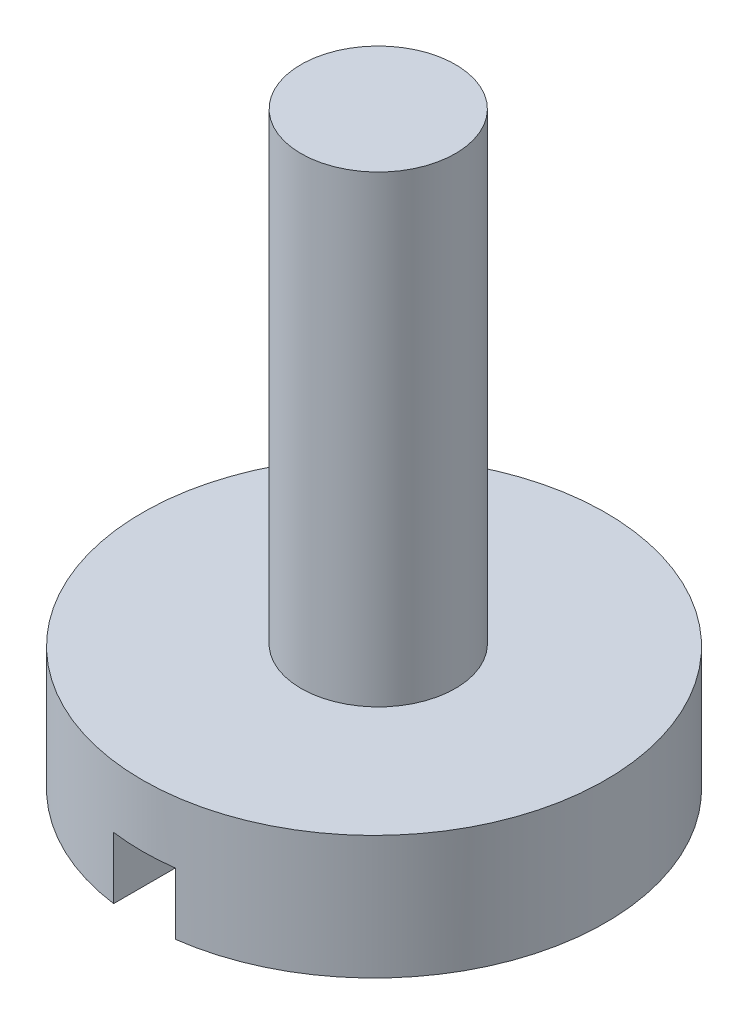
ISO-10303-21;
HEADER;
FILE_DESCRIPTION(('STEP AP214'),'2;1');
FILE_NAME('part.step','',(''),(''),'','','');
FILE_SCHEMA(('AUTOMOTIVE_DESIGN { 1 0 10303 214 1 1 1 1 }'));
ENDSEC;
DATA;
#1=APPLICATION_CONTEXT('core data for automotive mechanical design processes');
#2=APPLICATION_PROTOCOL_DEFINITION('international standard','automotive_design',2000,#1);
#3=PRODUCT_CONTEXT('',#1,'mechanical');
#4=PRODUCT('Part','Part','',(#3));
#5=PRODUCT_RELATED_PRODUCT_CATEGORY('part','',(#4));
#6=PRODUCT_DEFINITION_FORMATION('','',#4);
#7=PRODUCT_DEFINITION_CONTEXT('part definition',#1,'design');
#8=PRODUCT_DEFINITION('design','',#6,#7);
#9=PRODUCT_DEFINITION_SHAPE('','',#8);
#10=(LENGTH_UNIT() NAMED_UNIT(*) SI_UNIT(.MILLI.,.METRE.));
#11=(NAMED_UNIT(*) PLANE_ANGLE_UNIT() SI_UNIT($,.RADIAN.));
#12=(NAMED_UNIT(*) SI_UNIT($,.STERADIAN.) SOLID_ANGLE_UNIT());
#13=UNCERTAINTY_MEASURE_WITH_UNIT(LENGTH_MEASURE(1.E-05),#10,'distance_accuracy_value','');
#14=(GEOMETRIC_REPRESENTATION_CONTEXT(3) GLOBAL_UNCERTAINTY_ASSIGNED_CONTEXT((#13)) GLOBAL_UNIT_ASSIGNED_CONTEXT((#10,
#11,#12)) REPRESENTATION_CONTEXT('',''));
#15=CARTESIAN_POINT('',(0.,0.,0.));
#16=DIRECTION('',(0.,0.,1.));
#17=DIRECTION('',(1.,0.,0.));
#18=AXIS2_PLACEMENT_3D('',#15,#16,#17);
#19=CARTESIAN_POINT('',(0.,0.,0.));
#20=DIRECTION('',(0.,1.,0.));
#21=DIRECTION('',(0.,0.,1.));
#22=AXIS2_PLACEMENT_3D('',#19,#20,#21);
#23=PLANE('',#22);
#24=CARTESIAN_POINT('',(0.,0.,0.));
#25=DIRECTION('',(0.,1.,0.));
#26=DIRECTION('',(0.,0.,1.));
#27=AXIS2_PLACEMENT_3D('',#24,#25,#26);
#28=CIRCLE('',#27,7.5);
#29=CARTESIAN_POINT('',(1.,0.,7.43303437365925));
#30=VERTEX_POINT('',#29);
#31=CARTESIAN_POINT('',(1.,0.,-7.43303437365925));
#32=VERTEX_POINT('',#31);
#33=EDGE_CURVE('E90',#30,#32,#28,.T.);
#34=ORIENTED_EDGE('',*,*,#33,.F.);
#35=DIRECTION('',(0.,0.,-1.));
#36=VECTOR('',#35,1.);
#37=CARTESIAN_POINT('',(1.,0.,0.));
#38=LINE('',#37,#36);
#39=EDGE_CURVE('E80',#30,#32,#38,.T.);
#40=ORIENTED_EDGE('',*,*,#39,.T.);
#41=EDGE_LOOP('',(#34,#40));
#42=FACE_BOUND('',#41,.T.);
#43=ADVANCED_FACE('F35',(#42),#23,.F.);
#44=CARTESIAN_POINT('',(0.,4.,0.));
#45=DIRECTION('',(0.,1.,0.));
#46=DIRECTION('',(0.,0.,1.));
#47=AXIS2_PLACEMENT_3D('',#44,#45,#46);
#48=PLANE('',#47);
#49=CARTESIAN_POINT('',(0.,4.,0.));
#50=DIRECTION('',(0.,1.,0.));
#51=DIRECTION('',(0.,0.,1.));
#52=AXIS2_PLACEMENT_3D('',#49,#50,#51);
#53=CIRCLE('',#52,7.5);
#54=CARTESIAN_POINT('',(0.,4.,7.5));
#55=VERTEX_POINT('',#54);
#56=EDGE_CURVE('E81',#55,#55,#53,.T.);
#57=ORIENTED_EDGE('',*,*,#56,.T.);
#58=EDGE_LOOP('',(#57));
#59=FACE_BOUND('',#58,.T.);
#60=CARTESIAN_POINT('',(0.,4.,-0.136309695628481));
#61=DIRECTION('',(0.,1.,0.));
#62=DIRECTION('',(0.,0.,1.));
#63=AXIS2_PLACEMENT_3D('',#60,#61,#62);
#64=CIRCLE('',#63,2.5);
#65=CARTESIAN_POINT('',(0.,4.,2.36369030437152));
#66=VERTEX_POINT('',#65);
#67=EDGE_CURVE('E95',#66,#66,#64,.T.);
#68=ORIENTED_EDGE('',*,*,#67,.F.);
#69=EDGE_LOOP('',(#68));
#70=FACE_BOUND('',#69,.T.);
#71=ADVANCED_FACE('F120',(#59,#70),#48,.T.);
#72=CARTESIAN_POINT('',(0.,4.,0.));
#73=DIRECTION('',(0.,-1.,0.));
#74=DIRECTION('',(0.,0.,-1.));
#75=AXIS2_PLACEMENT_3D('',#72,#73,#74);
#76=CYLINDRICAL_SURFACE('',#75,7.5);
#77=CARTESIAN_POINT('',(0.,2.,0.));
#78=DIRECTION('',(0.,-1.,0.));
#79=DIRECTION('',(0.,0.,-1.));
#80=AXIS2_PLACEMENT_3D('',#77,#78,#79);
#81=CIRCLE('',#80,7.5);
#82=CARTESIAN_POINT('',(1.,2.,7.43303437365925));
#83=VERTEX_POINT('',#82);
#84=CARTESIAN_POINT('',(-1.,2.,7.43303437365925));
#85=VERTEX_POINT('',#84);
#86=EDGE_CURVE('E11',#83,#85,#81,.T.);
#87=ORIENTED_EDGE('',*,*,#86,.F.);
#88=DIRECTION('',(0.,-1.,0.));
#89=VECTOR('',#88,1.);
#90=CARTESIAN_POINT('',(1.,4.,7.43303437365925));
#91=LINE('',#90,#89);
#92=EDGE_CURVE('E110',#83,#30,#91,.T.);
#93=ORIENTED_EDGE('',*,*,#92,.T.);
#94=ORIENTED_EDGE('',*,*,#33,.T.);
#95=DIRECTION('',(0.,-1.,0.));
#96=VECTOR('',#95,1.);
#97=CARTESIAN_POINT('',(1.,4.,-7.43303437365925));
#98=LINE('',#97,#96);
#99=CARTESIAN_POINT('',(1.,2.,-7.43303437365925));
#100=VERTEX_POINT('',#99);
#101=EDGE_CURVE('E87',#32,#100,#98,.F.);
#102=ORIENTED_EDGE('',*,*,#101,.T.);
#103=CARTESIAN_POINT('',(-1.,2.,-7.43303437365925));
#104=VERTEX_POINT('',#103);
#105=EDGE_CURVE('E39',#104,#100,#81,.T.);
#106=ORIENTED_EDGE('',*,*,#105,.F.);
#107=DIRECTION('',(0.,-1.,0.));
#108=VECTOR('',#107,1.);
#109=CARTESIAN_POINT('',(-1.,4.,-7.43303437365925));
#110=LINE('',#109,#108);
#111=CARTESIAN_POINT('',(-1.,0.,-7.43303437365925));
#112=VERTEX_POINT('',#111);
#113=EDGE_CURVE('E75',#104,#112,#110,.T.);
#114=ORIENTED_EDGE('',*,*,#113,.T.);
#115=CARTESIAN_POINT('',(-1.,0.,7.43303437365925));
#116=VERTEX_POINT('',#115);
#117=EDGE_CURVE('E85',#112,#116,#28,.T.);
#118=ORIENTED_EDGE('',*,*,#117,.T.);
#119=DIRECTION('',(0.,-1.,0.));
#120=VECTOR('',#119,1.);
#121=CARTESIAN_POINT('',(-1.,4.,7.43303437365925));
#122=LINE('',#121,#120);
#123=EDGE_CURVE('E50',#116,#85,#122,.F.);
#124=ORIENTED_EDGE('',*,*,#123,.T.);
#125=EDGE_LOOP('',(#87,#93,#94,#102,#106,#114,#118,#124));
#126=FACE_BOUND('',#125,.T.);
#127=ORIENTED_EDGE('',*,*,#56,.F.);
#128=EDGE_LOOP('',(#127));
#129=FACE_BOUND('',#128,.T.);
#130=ADVANCED_FACE('F37',(#126,#129),#76,.T.);
#131=ORIENTED_EDGE('',*,*,#117,.F.);
#132=DIRECTION('',(0.,0.,1.));
#133=VECTOR('',#132,1.);
#134=CARTESIAN_POINT('',(-1.,0.,0.));
#135=LINE('',#134,#133);
#136=EDGE_CURVE('E72',#112,#116,#135,.T.);
#137=ORIENTED_EDGE('',*,*,#136,.T.);
#138=EDGE_LOOP('',(#131,#137));
#139=FACE_BOUND('',#138,.T.);
#140=ADVANCED_FACE('F89',(#139),#23,.F.);
#141=CARTESIAN_POINT('',(0.,19.,-0.136309695628481));
#142=DIRECTION('',(0.,-1.,0.));
#143=DIRECTION('',(0.,0.,-1.));
#144=AXIS2_PLACEMENT_3D('',#141,#142,#143);
#145=CYLINDRICAL_SURFACE('',#144,2.5);
#146=CARTESIAN_POINT('',(0.,19.,-0.136309695628481));
#147=DIRECTION('',(0.,1.,0.));
#148=DIRECTION('',(0.,0.,1.));
#149=AXIS2_PLACEMENT_3D('',#146,#147,#148);
#150=CIRCLE('',#149,2.5);
#151=CARTESIAN_POINT('',(0.,19.,2.36369030437152));
#152=VERTEX_POINT('',#151);
#153=EDGE_CURVE('E91',#152,#152,#150,.T.);
#154=ORIENTED_EDGE('',*,*,#153,.F.);
#155=EDGE_LOOP('',(#154));
#156=FACE_BOUND('',#155,.T.);
#157=ORIENTED_EDGE('',*,*,#67,.T.);
#158=EDGE_LOOP('',(#157));
#159=FACE_BOUND('',#158,.T.);
#160=ADVANCED_FACE('F118',(#156,#159),#145,.T.);
#161=CARTESIAN_POINT('',(0.,19.,-0.136309695628481));
#162=DIRECTION('',(0.,1.,0.));
#163=DIRECTION('',(0.,0.,1.));
#164=AXIS2_PLACEMENT_3D('',#161,#162,#163);
#165=PLANE('',#164);
#166=ORIENTED_EDGE('',*,*,#153,.T.);
#167=EDGE_LOOP('',(#166));
#168=FACE_BOUND('',#167,.T.);
#169=ADVANCED_FACE('F137',(#168),#165,.T.);
#170=CARTESIAN_POINT('',(0.,2.,0.));
#171=DIRECTION('',(0.,-1.,0.));
#172=DIRECTION('',(0.,0.,-1.));
#173=AXIS2_PLACEMENT_3D('',#170,#171,#172);
#174=PLANE('',#173);
#175=DIRECTION('',(0.,0.,1.));
#176=VECTOR('',#175,1.);
#177=CARTESIAN_POINT('',(1.,2.,7.5));
#178=LINE('',#177,#176);
#179=EDGE_CURVE('E106',#100,#83,#178,.T.);
#180=ORIENTED_EDGE('',*,*,#179,.T.);
#181=ORIENTED_EDGE('',*,*,#86,.T.);
#182=DIRECTION('',(0.,0.,-1.));
#183=VECTOR('',#182,1.);
#184=CARTESIAN_POINT('',(-1.,2.,7.5));
#185=LINE('',#184,#183);
#186=EDGE_CURVE('E107',#85,#104,#185,.T.);
#187=ORIENTED_EDGE('',*,*,#186,.T.);
#188=ORIENTED_EDGE('',*,*,#105,.T.);
#189=EDGE_LOOP('',(#180,#181,#187,#188));
#190=FACE_BOUND('',#189,.T.);
#191=ADVANCED_FACE('F105',(#190),#174,.T.);
#192=CARTESIAN_POINT('',(1.,2.,7.5));
#193=DIRECTION('',(1.,0.,0.));
#194=DIRECTION('',(0.,0.,-1.));
#195=AXIS2_PLACEMENT_3D('',#192,#193,#194);
#196=PLANE('',#195);
#197=ORIENTED_EDGE('',*,*,#179,.F.);
#198=ORIENTED_EDGE('',*,*,#101,.F.);
#199=ORIENTED_EDGE('',*,*,#39,.F.);
#200=ORIENTED_EDGE('',*,*,#92,.F.);
#201=EDGE_LOOP('',(#197,#198,#199,#200));
#202=FACE_BOUND('',#201,.T.);
#203=ADVANCED_FACE('F109',(#202),#196,.F.);
#204=CARTESIAN_POINT('',(-1.,2.,7.5));
#205=DIRECTION('',(-1.,0.,0.));
#206=DIRECTION('',(0.,0.,1.));
#207=AXIS2_PLACEMENT_3D('',#204,#205,#206);
#208=PLANE('',#207);
#209=ORIENTED_EDGE('',*,*,#186,.F.);
#210=ORIENTED_EDGE('',*,*,#123,.F.);
#211=ORIENTED_EDGE('',*,*,#136,.F.);
#212=ORIENTED_EDGE('',*,*,#113,.F.);
#213=EDGE_LOOP('',(#209,#210,#211,#212));
#214=FACE_BOUND('',#213,.T.);
#215=ADVANCED_FACE('F74',(#214),#208,.F.);
#216=CLOSED_SHELL('',(#43,#71,#130,#140,#160,#169,#191,#203,#215));
#217=MANIFOLD_SOLID_BREP('B2',#216);
#218=ADVANCED_BREP_SHAPE_REPRESENTATION('',(#18,#217),#14);
#219=SHAPE_DEFINITION_REPRESENTATION(#9,#218);
ENDSEC;
END-ISO-10303-21;
